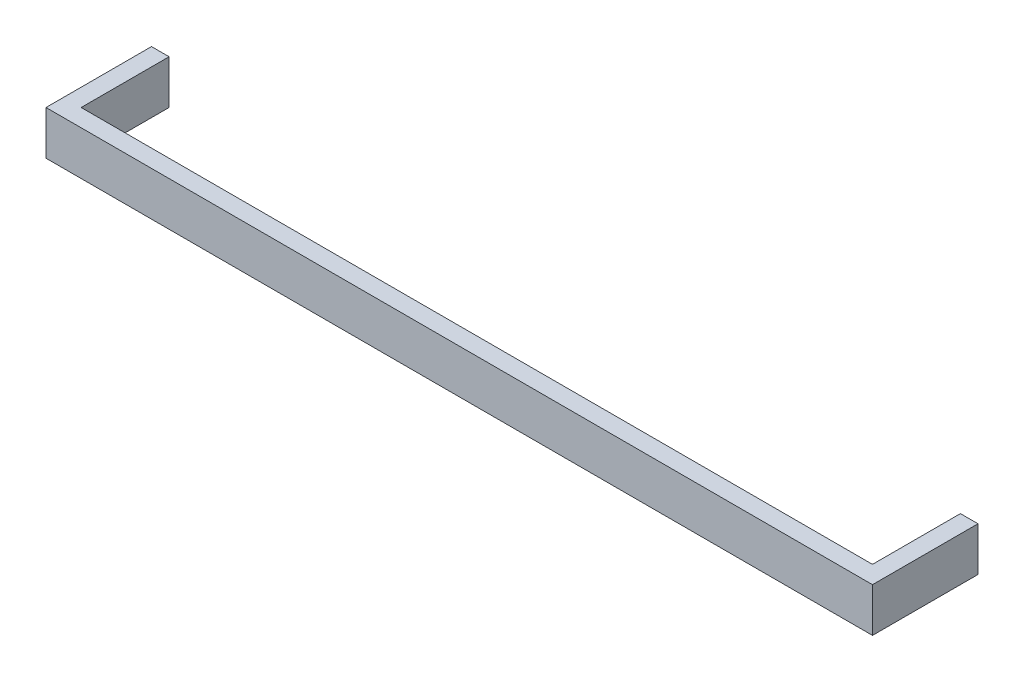
ISO-10303-21;
HEADER;
FILE_DESCRIPTION(('STEP AP214'),'2;1');
FILE_NAME('part.step','',(''),(''),'','','');
FILE_SCHEMA(('AUTOMOTIVE_DESIGN { 1 0 10303 214 1 1 1 1 }'));
ENDSEC;
DATA;
#1=APPLICATION_CONTEXT('core data for automotive mechanical design processes');
#2=APPLICATION_PROTOCOL_DEFINITION('international standard','automotive_design',2000,#1);
#3=PRODUCT_CONTEXT('',#1,'mechanical');
#4=PRODUCT('Part','Part','',(#3));
#5=PRODUCT_RELATED_PRODUCT_CATEGORY('part','',(#4));
#6=PRODUCT_DEFINITION_FORMATION('','',#4);
#7=PRODUCT_DEFINITION_CONTEXT('part definition',#1,'design');
#8=PRODUCT_DEFINITION('design','',#6,#7);
#9=PRODUCT_DEFINITION_SHAPE('','',#8);
#10=(LENGTH_UNIT() NAMED_UNIT(*) SI_UNIT(.MILLI.,.METRE.));
#11=(NAMED_UNIT(*) PLANE_ANGLE_UNIT() SI_UNIT($,.RADIAN.));
#12=(NAMED_UNIT(*) SI_UNIT($,.STERADIAN.) SOLID_ANGLE_UNIT());
#13=UNCERTAINTY_MEASURE_WITH_UNIT(LENGTH_MEASURE(1.E-05),#10,'distance_accuracy_value','');
#14=(GEOMETRIC_REPRESENTATION_CONTEXT(3) GLOBAL_UNCERTAINTY_ASSIGNED_CONTEXT((#13)) GLOBAL_UNIT_ASSIGNED_CONTEXT((#10,
#11,#12)) REPRESENTATION_CONTEXT('',''));
#15=CARTESIAN_POINT('',(0.,0.,0.));
#16=DIRECTION('',(0.,0.,1.));
#17=DIRECTION('',(1.,0.,0.));
#18=AXIS2_PLACEMENT_3D('',#15,#16,#17);
#19=CARTESIAN_POINT('',(0.,5.,-10.));
#20=DIRECTION('',(-1.,0.,0.));
#21=DIRECTION('',(0.,0.,1.));
#22=AXIS2_PLACEMENT_3D('',#19,#20,#21);
#23=PLANE('',#22);
#24=DIRECTION('',(0.,0.,-1.));
#25=VECTOR('',#24,1.);
#26=CARTESIAN_POINT('',(0.,0.,-10.));
#27=LINE('',#26,#25);
#28=CARTESIAN_POINT('',(0.,0.,0.));
#29=VERTEX_POINT('',#28);
#30=CARTESIAN_POINT('',(0.,0.,-10.));
#31=VERTEX_POINT('',#30);
#32=EDGE_CURVE('E140',#29,#31,#27,.T.);
#33=ORIENTED_EDGE('',*,*,#32,.T.);
#34=DIRECTION('',(0.,-1.,0.));
#35=VECTOR('',#34,1.);
#36=CARTESIAN_POINT('',(0.,5.,-10.));
#37=LINE('',#36,#35);
#38=CARTESIAN_POINT('',(0.,5.,-10.));
#39=VERTEX_POINT('',#38);
#40=EDGE_CURVE('E11',#39,#31,#37,.T.);
#41=ORIENTED_EDGE('',*,*,#40,.F.);
#42=DIRECTION('',(0.,0.,-1.));
#43=VECTOR('',#42,1.);
#44=CARTESIAN_POINT('',(0.,5.,-10.));
#45=LINE('',#44,#43);
#46=CARTESIAN_POINT('',(0.,5.,0.));
#47=VERTEX_POINT('',#46);
#48=EDGE_CURVE('E162',#47,#39,#45,.T.);
#49=ORIENTED_EDGE('',*,*,#48,.F.);
#50=DIRECTION('',(0.,-1.,0.));
#51=VECTOR('',#50,1.);
#52=CARTESIAN_POINT('',(0.,5.,0.));
#53=LINE('',#52,#51);
#54=EDGE_CURVE('E136',#47,#29,#53,.T.);
#55=ORIENTED_EDGE('',*,*,#54,.T.);
#56=EDGE_LOOP('',(#33,#41,#49,#55));
#57=FACE_BOUND('',#56,.T.);
#58=ADVANCED_FACE('F39',(#57),#23,.F.);
#59=CARTESIAN_POINT('',(-2.,5.,-10.));
#60=DIRECTION('',(0.,0.,1.));
#61=DIRECTION('',(1.,0.,0.));
#62=AXIS2_PLACEMENT_3D('',#59,#60,#61);
#63=PLANE('',#62);
#64=DIRECTION('',(-1.,0.,0.));
#65=VECTOR('',#64,1.);
#66=CARTESIAN_POINT('',(-2.,0.,-10.));
#67=LINE('',#66,#65);
#68=CARTESIAN_POINT('',(-2.,0.,-10.));
#69=VERTEX_POINT('',#68);
#70=EDGE_CURVE('E144',#31,#69,#67,.T.);
#71=ORIENTED_EDGE('',*,*,#70,.T.);
#72=DIRECTION('',(0.,-1.,0.));
#73=VECTOR('',#72,1.);
#74=CARTESIAN_POINT('',(-2.,5.,-10.));
#75=LINE('',#74,#73);
#76=CARTESIAN_POINT('',(-2.,5.,-10.));
#77=VERTEX_POINT('',#76);
#78=EDGE_CURVE('E48',#77,#69,#75,.T.);
#79=ORIENTED_EDGE('',*,*,#78,.F.);
#80=DIRECTION('',(-1.,0.,0.));
#81=VECTOR('',#80,1.);
#82=CARTESIAN_POINT('',(-2.,5.,-10.));
#83=LINE('',#82,#81);
#84=EDGE_CURVE('E99',#39,#77,#83,.T.);
#85=ORIENTED_EDGE('',*,*,#84,.F.);
#86=ORIENTED_EDGE('',*,*,#40,.T.);
#87=EDGE_LOOP('',(#71,#79,#85,#86));
#88=FACE_BOUND('',#87,.T.);
#89=ADVANCED_FACE('F208',(#88),#63,.F.);
#90=CARTESIAN_POINT('',(-2.,5.,2.00000000000001));
#91=DIRECTION('',(1.,0.,0.));
#92=DIRECTION('',(0.,0.,-1.));
#93=AXIS2_PLACEMENT_3D('',#90,#91,#92);
#94=PLANE('',#93);
#95=DIRECTION('',(0.,0.,1.));
#96=VECTOR('',#95,1.);
#97=CARTESIAN_POINT('',(-2.,0.,2.00000000000001));
#98=LINE('',#97,#96);
#99=CARTESIAN_POINT('',(-2.,0.,2.00000000000001));
#100=VERTEX_POINT('',#99);
#101=EDGE_CURVE('E147',#69,#100,#98,.T.);
#102=ORIENTED_EDGE('',*,*,#101,.T.);
#103=DIRECTION('',(0.,-1.,0.));
#104=VECTOR('',#103,1.);
#105=CARTESIAN_POINT('',(-2.,5.,2.00000000000001));
#106=LINE('',#105,#104);
#107=CARTESIAN_POINT('',(-2.,5.,2.00000000000001));
#108=VERTEX_POINT('',#107);
#109=EDGE_CURVE('E173',#108,#100,#106,.T.);
#110=ORIENTED_EDGE('',*,*,#109,.F.);
#111=DIRECTION('',(0.,0.,1.));
#112=VECTOR('',#111,1.);
#113=CARTESIAN_POINT('',(-2.,5.,2.00000000000001));
#114=LINE('',#113,#112);
#115=EDGE_CURVE('E183',#77,#108,#114,.T.);
#116=ORIENTED_EDGE('',*,*,#115,.F.);
#117=ORIENTED_EDGE('',*,*,#78,.T.);
#118=EDGE_LOOP('',(#102,#110,#116,#117));
#119=FACE_BOUND('',#118,.T.);
#120=ADVANCED_FACE('F181',(#119),#94,.F.);
#121=CARTESIAN_POINT('',(92.,5.,2.));
#122=DIRECTION('',(0.,0.,-1.));
#123=DIRECTION('',(-1.,0.,0.));
#124=AXIS2_PLACEMENT_3D('',#121,#122,#123);
#125=PLANE('',#124);
#126=DIRECTION('',(1.,0.,0.));
#127=VECTOR('',#126,1.);
#128=CARTESIAN_POINT('',(92.,0.,2.));
#129=LINE('',#128,#127);
#130=CARTESIAN_POINT('',(92.,0.,2.));
#131=VERTEX_POINT('',#130);
#132=EDGE_CURVE('E150',#100,#131,#129,.T.);
#133=ORIENTED_EDGE('',*,*,#132,.T.);
#134=DIRECTION('',(0.,-1.,0.));
#135=VECTOR('',#134,1.);
#136=CARTESIAN_POINT('',(92.,5.,2.));
#137=LINE('',#136,#135);
#138=CARTESIAN_POINT('',(92.,5.,2.));
#139=VERTEX_POINT('',#138);
#140=EDGE_CURVE('E169',#139,#131,#137,.T.);
#141=ORIENTED_EDGE('',*,*,#140,.F.);
#142=DIRECTION('',(1.,0.,0.));
#143=VECTOR('',#142,1.);
#144=CARTESIAN_POINT('',(92.,5.,2.));
#145=LINE('',#144,#143);
#146=EDGE_CURVE('E196',#108,#139,#145,.T.);
#147=ORIENTED_EDGE('',*,*,#146,.F.);
#148=ORIENTED_EDGE('',*,*,#109,.T.);
#149=EDGE_LOOP('',(#133,#141,#147,#148));
#150=FACE_BOUND('',#149,.T.);
#151=ADVANCED_FACE('F191',(#150),#125,.F.);
#152=CARTESIAN_POINT('',(92.,5.,-10.));
#153=DIRECTION('',(-1.,0.,0.));
#154=DIRECTION('',(0.,0.,1.));
#155=AXIS2_PLACEMENT_3D('',#152,#153,#154);
#156=PLANE('',#155);
#157=DIRECTION('',(0.,0.,-1.));
#158=VECTOR('',#157,1.);
#159=CARTESIAN_POINT('',(92.,0.,-10.));
#160=LINE('',#159,#158);
#161=CARTESIAN_POINT('',(92.,0.,-10.));
#162=VERTEX_POINT('',#161);
#163=EDGE_CURVE('E153',#131,#162,#160,.T.);
#164=ORIENTED_EDGE('',*,*,#163,.T.);
#165=DIRECTION('',(0.,-1.,0.));
#166=VECTOR('',#165,1.);
#167=CARTESIAN_POINT('',(92.,5.,-10.));
#168=LINE('',#167,#166);
#169=CARTESIAN_POINT('',(92.,5.,-10.));
#170=VERTEX_POINT('',#169);
#171=EDGE_CURVE('E129',#170,#162,#168,.T.);
#172=ORIENTED_EDGE('',*,*,#171,.F.);
#173=DIRECTION('',(0.,0.,-1.));
#174=VECTOR('',#173,1.);
#175=CARTESIAN_POINT('',(92.,5.,-10.));
#176=LINE('',#175,#174);
#177=EDGE_CURVE('E118',#139,#170,#176,.T.);
#178=ORIENTED_EDGE('',*,*,#177,.F.);
#179=ORIENTED_EDGE('',*,*,#140,.T.);
#180=EDGE_LOOP('',(#164,#172,#178,#179));
#181=FACE_BOUND('',#180,.T.);
#182=ADVANCED_FACE('F194',(#181),#156,.F.);
#183=CARTESIAN_POINT('',(90.,5.,-10.));
#184=DIRECTION('',(0.,0.,1.));
#185=DIRECTION('',(1.,0.,0.));
#186=AXIS2_PLACEMENT_3D('',#183,#184,#185);
#187=PLANE('',#186);
#188=DIRECTION('',(-1.,0.,0.));
#189=VECTOR('',#188,1.);
#190=CARTESIAN_POINT('',(90.,0.,-10.));
#191=LINE('',#190,#189);
#192=CARTESIAN_POINT('',(90.,0.,-10.));
#193=VERTEX_POINT('',#192);
#194=EDGE_CURVE('E127',#162,#193,#191,.T.);
#195=ORIENTED_EDGE('',*,*,#194,.T.);
#196=DIRECTION('',(0.,-1.,0.));
#197=VECTOR('',#196,1.);
#198=CARTESIAN_POINT('',(90.,5.,-10.));
#199=LINE('',#198,#197);
#200=CARTESIAN_POINT('',(90.,5.,-10.));
#201=VERTEX_POINT('',#200);
#202=EDGE_CURVE('E124',#201,#193,#199,.T.);
#203=ORIENTED_EDGE('',*,*,#202,.F.);
#204=DIRECTION('',(-1.,0.,0.));
#205=VECTOR('',#204,1.);
#206=CARTESIAN_POINT('',(90.,5.,-10.));
#207=LINE('',#206,#205);
#208=EDGE_CURVE('E112',#170,#201,#207,.T.);
#209=ORIENTED_EDGE('',*,*,#208,.F.);
#210=ORIENTED_EDGE('',*,*,#171,.T.);
#211=EDGE_LOOP('',(#195,#203,#209,#210));
#212=FACE_BOUND('',#211,.T.);
#213=ADVANCED_FACE('F125',(#212),#187,.F.);
#214=CARTESIAN_POINT('',(90.,5.,0.));
#215=DIRECTION('',(1.,0.,0.));
#216=DIRECTION('',(0.,0.,-1.));
#217=AXIS2_PLACEMENT_3D('',#214,#215,#216);
#218=PLANE('',#217);
#219=DIRECTION('',(0.,0.,1.));
#220=VECTOR('',#219,1.);
#221=CARTESIAN_POINT('',(90.,0.,0.));
#222=LINE('',#221,#220);
#223=CARTESIAN_POINT('',(90.,0.,0.));
#224=VERTEX_POINT('',#223);
#225=EDGE_CURVE('E85',#193,#224,#222,.T.);
#226=ORIENTED_EDGE('',*,*,#225,.T.);
#227=DIRECTION('',(0.,-1.,0.));
#228=VECTOR('',#227,1.);
#229=CARTESIAN_POINT('',(90.,5.,0.));
#230=LINE('',#229,#228);
#231=CARTESIAN_POINT('',(90.,5.,0.));
#232=VERTEX_POINT('',#231);
#233=EDGE_CURVE('E130',#232,#224,#230,.T.);
#234=ORIENTED_EDGE('',*,*,#233,.F.);
#235=DIRECTION('',(0.,0.,1.));
#236=VECTOR('',#235,1.);
#237=CARTESIAN_POINT('',(90.,5.,0.));
#238=LINE('',#237,#236);
#239=EDGE_CURVE('E116',#201,#232,#238,.T.);
#240=ORIENTED_EDGE('',*,*,#239,.F.);
#241=ORIENTED_EDGE('',*,*,#202,.T.);
#242=EDGE_LOOP('',(#226,#234,#240,#241));
#243=FACE_BOUND('',#242,.T.);
#244=ADVANCED_FACE('F132',(#243),#218,.F.);
#245=CARTESIAN_POINT('',(0.,5.,0.));
#246=DIRECTION('',(0.,0.,1.));
#247=DIRECTION('',(1.,0.,0.));
#248=AXIS2_PLACEMENT_3D('',#245,#246,#247);
#249=PLANE('',#248);
#250=DIRECTION('',(-1.,0.,0.));
#251=VECTOR('',#250,1.);
#252=CARTESIAN_POINT('',(0.,0.,0.));
#253=LINE('',#252,#251);
#254=EDGE_CURVE('E91',#224,#29,#253,.T.);
#255=ORIENTED_EDGE('',*,*,#254,.T.);
#256=ORIENTED_EDGE('',*,*,#54,.F.);
#257=DIRECTION('',(-1.,0.,0.));
#258=VECTOR('',#257,1.);
#259=CARTESIAN_POINT('',(0.,5.,0.));
#260=LINE('',#259,#258);
#261=EDGE_CURVE('E56',#232,#47,#260,.T.);
#262=ORIENTED_EDGE('',*,*,#261,.F.);
#263=ORIENTED_EDGE('',*,*,#233,.T.);
#264=EDGE_LOOP('',(#255,#256,#262,#263));
#265=FACE_BOUND('',#264,.T.);
#266=ADVANCED_FACE('F224',(#265),#249,.F.);
#267=CARTESIAN_POINT('',(0.,5.,0.));
#268=DIRECTION('',(0.,1.,0.));
#269=DIRECTION('',(0.,0.,1.));
#270=AXIS2_PLACEMENT_3D('',#267,#268,#269);
#271=PLANE('',#270);
#272=ORIENTED_EDGE('',*,*,#48,.T.);
#273=ORIENTED_EDGE('',*,*,#84,.T.);
#274=ORIENTED_EDGE('',*,*,#115,.T.);
#275=ORIENTED_EDGE('',*,*,#146,.T.);
#276=ORIENTED_EDGE('',*,*,#177,.T.);
#277=ORIENTED_EDGE('',*,*,#208,.T.);
#278=ORIENTED_EDGE('',*,*,#239,.T.);
#279=ORIENTED_EDGE('',*,*,#261,.T.);
#280=EDGE_LOOP('',(#272,#273,#274,#275,#276,#277,#278,#279));
#281=FACE_BOUND('',#280,.T.);
#282=ADVANCED_FACE('F114',(#281),#271,.T.);
#283=CARTESIAN_POINT('',(0.,0.,0.));
#284=DIRECTION('',(0.,1.,0.));
#285=DIRECTION('',(0.,0.,1.));
#286=AXIS2_PLACEMENT_3D('',#283,#284,#285);
#287=PLANE('',#286);
#288=ORIENTED_EDGE('',*,*,#32,.F.);
#289=ORIENTED_EDGE('',*,*,#254,.F.);
#290=ORIENTED_EDGE('',*,*,#225,.F.);
#291=ORIENTED_EDGE('',*,*,#194,.F.);
#292=ORIENTED_EDGE('',*,*,#163,.F.);
#293=ORIENTED_EDGE('',*,*,#132,.F.);
#294=ORIENTED_EDGE('',*,*,#101,.F.);
#295=ORIENTED_EDGE('',*,*,#70,.F.);
#296=EDGE_LOOP('',(#288,#289,#290,#291,#292,#293,#294,#295));
#297=FACE_BOUND('',#296,.T.);
#298=ADVANCED_FACE('F187',(#297),#287,.F.);
#299=CLOSED_SHELL('',(#58,#89,#120,#151,#182,#213,#244,#266,#282,#298));
#300=MANIFOLD_SOLID_BREP('B2',#299);
#301=ADVANCED_BREP_SHAPE_REPRESENTATION('',(#18,#300),#14);
#302=SHAPE_DEFINITION_REPRESENTATION(#9,#301);
ENDSEC;
END-ISO-10303-21;
